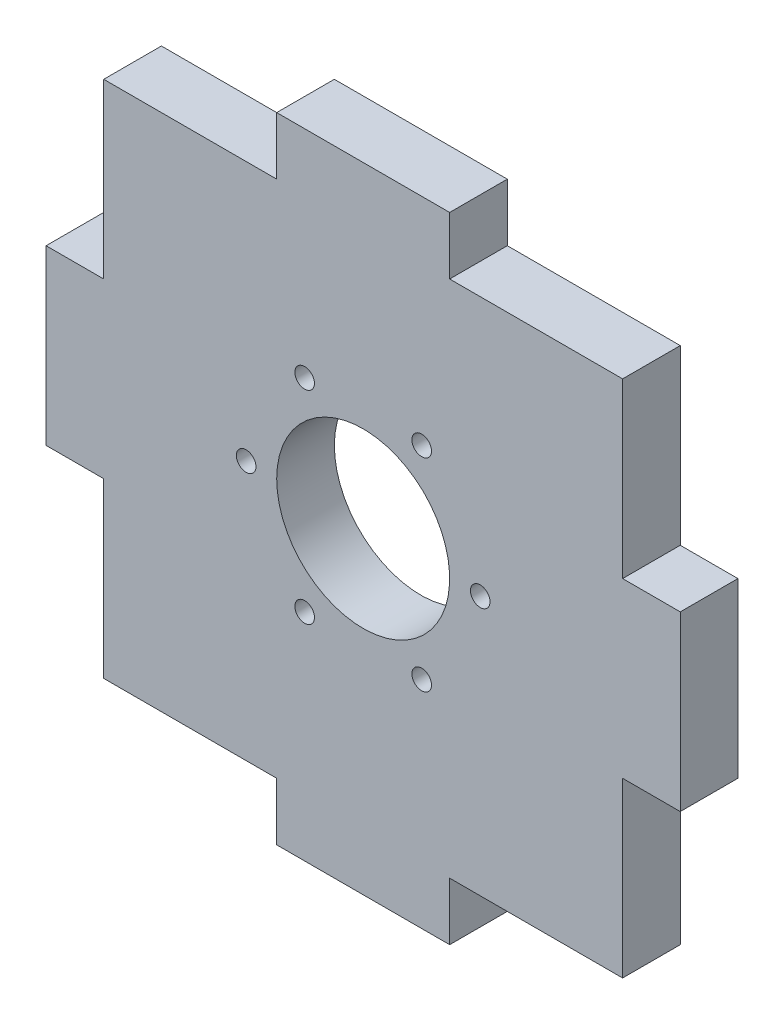
ISO-10303-21;
HEADER;
FILE_DESCRIPTION(('STEP AP214'),'2;1');
FILE_NAME('part.step','',(''),(''),'','','');
FILE_SCHEMA(('AUTOMOTIVE_DESIGN { 1 0 10303 214 1 1 1 1 }'));
ENDSEC;
DATA;
#1=APPLICATION_CONTEXT('core data for automotive mechanical design processes');
#2=APPLICATION_PROTOCOL_DEFINITION('international standard','automotive_design',2000,#1);
#3=PRODUCT_CONTEXT('',#1,'mechanical');
#4=PRODUCT('Part','Part','',(#3));
#5=PRODUCT_RELATED_PRODUCT_CATEGORY('part','',(#4));
#6=PRODUCT_DEFINITION_FORMATION('','',#4);
#7=PRODUCT_DEFINITION_CONTEXT('part definition',#1,'design');
#8=PRODUCT_DEFINITION('design','',#6,#7);
#9=PRODUCT_DEFINITION_SHAPE('','',#8);
#10=(LENGTH_UNIT() NAMED_UNIT(*) SI_UNIT(.MILLI.,.METRE.));
#11=(NAMED_UNIT(*) PLANE_ANGLE_UNIT() SI_UNIT($,.RADIAN.));
#12=(NAMED_UNIT(*) SI_UNIT($,.STERADIAN.) SOLID_ANGLE_UNIT());
#13=UNCERTAINTY_MEASURE_WITH_UNIT(LENGTH_MEASURE(1.E-05),#10,'distance_accuracy_value','');
#14=(GEOMETRIC_REPRESENTATION_CONTEXT(3) GLOBAL_UNCERTAINTY_ASSIGNED_CONTEXT((#13)) GLOBAL_UNIT_ASSIGNED_CONTEXT((#10,
#11,#12)) REPRESENTATION_CONTEXT('',''));
#15=CARTESIAN_POINT('',(0.,0.,0.));
#16=DIRECTION('',(0.,0.,1.));
#17=DIRECTION('',(1.,0.,0.));
#18=AXIS2_PLACEMENT_3D('',#15,#16,#17);
#19=CARTESIAN_POINT('',(19.75,22.5,5.));
#20=DIRECTION('',(0.,0.,-1.));
#21=DIRECTION('',(-1.,0.,0.));
#22=AXIS2_PLACEMENT_3D('',#19,#20,#21);
#23=PLANE('',#22);
#24=CARTESIAN_POINT('',(7.40000000000003,0.,5.));
#25=DIRECTION('',(0.,0.,-1.));
#26=DIRECTION('',(-1.,0.,0.));
#27=AXIS2_PLACEMENT_3D('',#24,#25,#26);
#28=CIRCLE('',#27,0.85);
#29=CARTESIAN_POINT('',(6.55000000000003,0.,5.));
#30=VERTEX_POINT('',#29);
#31=EDGE_CURVE('E309',#30,#30,#28,.F.);
#32=ORIENTED_EDGE('',*,*,#31,.F.);
#33=EDGE_LOOP('',(#32));
#34=FACE_BOUND('',#33,.T.);
#35=CARTESIAN_POINT('',(-7.82500000000002,-8.79015784841204,5.));
#36=DIRECTION('',(0.,0.,-1.));
#37=DIRECTION('',(-1.,0.,0.));
#38=AXIS2_PLACEMENT_3D('',#35,#36,#37);
#39=CIRCLE('',#38,0.85);
#40=CARTESIAN_POINT('',(-8.67500000000002,-8.79015784841204,5.));
#41=VERTEX_POINT('',#40);
#42=EDGE_CURVE('E303',#41,#41,#39,.F.);
#43=ORIENTED_EDGE('',*,*,#42,.F.);
#44=EDGE_LOOP('',(#43));
#45=FACE_BOUND('',#44,.T.);
#46=CARTESIAN_POINT('',(-7.82499999999989,8.7901578484121,5.));
#47=DIRECTION('',(0.,0.,-1.));
#48=DIRECTION('',(-1.,0.,0.));
#49=AXIS2_PLACEMENT_3D('',#46,#47,#48);
#50=CIRCLE('',#49,0.85);
#51=CARTESIAN_POINT('',(-8.67499999999989,8.7901578484121,5.));
#52=VERTEX_POINT('',#51);
#53=EDGE_CURVE('E295',#52,#52,#50,.F.);
#54=ORIENTED_EDGE('',*,*,#53,.F.);
#55=EDGE_LOOP('',(#54));
#56=FACE_BOUND('',#55,.T.);
#57=DIRECTION('',(0.,1.,0.));
#58=VECTOR('',#57,1.);
#59=CARTESIAN_POINT('',(19.75,7.5,5.));
#60=LINE('',#59,#58);
#61=CARTESIAN_POINT('',(19.75,7.5,5.));
#62=VERTEX_POINT('',#61);
#63=CARTESIAN_POINT('',(19.75,22.5,5.));
#64=VERTEX_POINT('',#63);
#65=EDGE_CURVE('E240',#62,#64,#60,.T.);
#66=ORIENTED_EDGE('',*,*,#65,.T.);
#67=DIRECTION('',(-1.,0.,0.));
#68=VECTOR('',#67,1.);
#69=CARTESIAN_POINT('',(4.74999999999998,22.5,5.));
#70=LINE('',#69,#68);
#71=CARTESIAN_POINT('',(4.74999999999998,22.5,5.));
#72=VERTEX_POINT('',#71);
#73=EDGE_CURVE('E128',#64,#72,#70,.T.);
#74=ORIENTED_EDGE('',*,*,#73,.T.);
#75=DIRECTION('',(0.,1.,0.));
#76=VECTOR('',#75,1.);
#77=CARTESIAN_POINT('',(4.74999999999998,22.5,5.));
#78=LINE('',#77,#76);
#79=CARTESIAN_POINT('',(4.74999999999998,27.5,5.));
#80=VERTEX_POINT('',#79);
#81=EDGE_CURVE('E325',#72,#80,#78,.T.);
#82=ORIENTED_EDGE('',*,*,#81,.T.);
#83=DIRECTION('',(-1.,0.,0.));
#84=VECTOR('',#83,1.);
#85=CARTESIAN_POINT('',(-10.25,27.5,5.));
#86=LINE('',#85,#84);
#87=CARTESIAN_POINT('',(-10.25,27.5,5.));
#88=VERTEX_POINT('',#87);
#89=EDGE_CURVE('E327',#80,#88,#86,.T.);
#90=ORIENTED_EDGE('',*,*,#89,.T.);
#91=DIRECTION('',(0.,-1.,0.));
#92=VECTOR('',#91,1.);
#93=CARTESIAN_POINT('',(-10.25,22.5,5.));
#94=LINE('',#93,#92);
#95=CARTESIAN_POINT('',(-10.25,22.5,5.));
#96=VERTEX_POINT('',#95);
#97=EDGE_CURVE('E329',#88,#96,#94,.T.);
#98=ORIENTED_EDGE('',*,*,#97,.T.);
#99=DIRECTION('',(-1.,0.,0.));
#100=VECTOR('',#99,1.);
#101=CARTESIAN_POINT('',(-25.25,22.5,5.));
#102=LINE('',#101,#100);
#103=CARTESIAN_POINT('',(-25.25,22.5,5.));
#104=VERTEX_POINT('',#103);
#105=EDGE_CURVE('E331',#96,#104,#102,.T.);
#106=ORIENTED_EDGE('',*,*,#105,.T.);
#107=DIRECTION('',(0.,-1.,0.));
#108=VECTOR('',#107,1.);
#109=CARTESIAN_POINT('',(-25.25,7.50000000000001,5.));
#110=LINE('',#109,#108);
#111=CARTESIAN_POINT('',(-25.25,7.50000000000001,5.));
#112=VERTEX_POINT('',#111);
#113=EDGE_CURVE('E333',#104,#112,#110,.T.);
#114=ORIENTED_EDGE('',*,*,#113,.T.);
#115=DIRECTION('',(-1.,0.,0.));
#116=VECTOR('',#115,1.);
#117=CARTESIAN_POINT('',(-25.25,7.50000000000001,5.));
#118=LINE('',#117,#116);
#119=CARTESIAN_POINT('',(-30.25,7.5,5.));
#120=VERTEX_POINT('',#119);
#121=EDGE_CURVE('E335',#112,#120,#118,.T.);
#122=ORIENTED_EDGE('',*,*,#121,.T.);
#123=DIRECTION('',(0.,-1.,0.));
#124=VECTOR('',#123,1.);
#125=CARTESIAN_POINT('',(-30.25,-7.5,5.));
#126=LINE('',#125,#124);
#127=CARTESIAN_POINT('',(-30.25,-7.5,5.));
#128=VERTEX_POINT('',#127);
#129=EDGE_CURVE('E337',#120,#128,#126,.T.);
#130=ORIENTED_EDGE('',*,*,#129,.T.);
#131=DIRECTION('',(1.,0.,0.));
#132=VECTOR('',#131,1.);
#133=CARTESIAN_POINT('',(-25.25,-7.5,5.));
#134=LINE('',#133,#132);
#135=CARTESIAN_POINT('',(-25.25,-7.5,5.));
#136=VERTEX_POINT('',#135);
#137=EDGE_CURVE('E339',#128,#136,#134,.T.);
#138=ORIENTED_EDGE('',*,*,#137,.T.);
#139=DIRECTION('',(0.,-1.,0.));
#140=VECTOR('',#139,1.);
#141=CARTESIAN_POINT('',(-25.25,-22.5,5.));
#142=LINE('',#141,#140);
#143=CARTESIAN_POINT('',(-25.25,-22.5,5.));
#144=VERTEX_POINT('',#143);
#145=EDGE_CURVE('E341',#136,#144,#142,.T.);
#146=ORIENTED_EDGE('',*,*,#145,.T.);
#147=DIRECTION('',(1.,0.,0.));
#148=VECTOR('',#147,1.);
#149=CARTESIAN_POINT('',(-25.25,-22.5,5.));
#150=LINE('',#149,#148);
#151=CARTESIAN_POINT('',(-10.25,-22.5,5.));
#152=VERTEX_POINT('',#151);
#153=EDGE_CURVE('E343',#144,#152,#150,.T.);
#154=ORIENTED_EDGE('',*,*,#153,.T.);
#155=DIRECTION('',(0.,-1.,0.));
#156=VECTOR('',#155,1.);
#157=CARTESIAN_POINT('',(-10.25,-22.5,5.));
#158=LINE('',#157,#156);
#159=CARTESIAN_POINT('',(-10.25,-27.5,5.));
#160=VERTEX_POINT('',#159);
#161=EDGE_CURVE('E345',#152,#160,#158,.T.);
#162=ORIENTED_EDGE('',*,*,#161,.T.);
#163=DIRECTION('',(1.,0.,0.));
#164=VECTOR('',#163,1.);
#165=CARTESIAN_POINT('',(4.74999999999998,-27.5,5.));
#166=LINE('',#165,#164);
#167=CARTESIAN_POINT('',(4.74999999999998,-27.5,5.));
#168=VERTEX_POINT('',#167);
#169=EDGE_CURVE('E347',#160,#168,#166,.T.);
#170=ORIENTED_EDGE('',*,*,#169,.T.);
#171=DIRECTION('',(0.,1.,0.));
#172=VECTOR('',#171,1.);
#173=CARTESIAN_POINT('',(4.74999999999998,-22.5,5.));
#174=LINE('',#173,#172);
#175=CARTESIAN_POINT('',(4.74999999999998,-22.5,5.));
#176=VERTEX_POINT('',#175);
#177=EDGE_CURVE('E349',#168,#176,#174,.T.);
#178=ORIENTED_EDGE('',*,*,#177,.T.);
#179=DIRECTION('',(1.,0.,0.));
#180=VECTOR('',#179,1.);
#181=CARTESIAN_POINT('',(4.74999999999998,-22.5,5.));
#182=LINE('',#181,#180);
#183=CARTESIAN_POINT('',(19.75,-22.5,5.));
#184=VERTEX_POINT('',#183);
#185=EDGE_CURVE('E351',#176,#184,#182,.T.);
#186=ORIENTED_EDGE('',*,*,#185,.T.);
#187=DIRECTION('',(0.,1.,0.));
#188=VECTOR('',#187,1.);
#189=CARTESIAN_POINT('',(19.75,-22.5,5.));
#190=LINE('',#189,#188);
#191=CARTESIAN_POINT('',(19.75,-7.5,5.));
#192=VERTEX_POINT('',#191);
#193=EDGE_CURVE('E183',#184,#192,#190,.T.);
#194=ORIENTED_EDGE('',*,*,#193,.T.);
#195=DIRECTION('',(1.,0.,0.));
#196=VECTOR('',#195,1.);
#197=CARTESIAN_POINT('',(19.75,-7.5,5.));
#198=LINE('',#197,#196);
#199=CARTESIAN_POINT('',(24.75,-7.5,5.));
#200=VERTEX_POINT('',#199);
#201=EDGE_CURVE('E177',#192,#200,#198,.T.);
#202=ORIENTED_EDGE('',*,*,#201,.T.);
#203=DIRECTION('',(0.,1.,0.));
#204=VECTOR('',#203,1.);
#205=CARTESIAN_POINT('',(24.75,7.5,5.));
#206=LINE('',#205,#204);
#207=CARTESIAN_POINT('',(24.75,7.5,5.));
#208=VERTEX_POINT('',#207);
#209=EDGE_CURVE('E181',#200,#208,#206,.T.);
#210=ORIENTED_EDGE('',*,*,#209,.T.);
#211=DIRECTION('',(-1.,0.,0.));
#212=VECTOR('',#211,1.);
#213=CARTESIAN_POINT('',(19.75,7.5,5.));
#214=LINE('',#213,#212);
#215=EDGE_CURVE('E49',#208,#62,#214,.T.);
#216=ORIENTED_EDGE('',*,*,#215,.T.);
#217=EDGE_LOOP('',(#66,#74,#82,#90,#98,#106,#114,#122,#130,#138,#146,#154,#162,#170,#178,#186,
#194,#202,#210,#216));
#218=FACE_BOUND('',#217,.T.);
#219=CARTESIAN_POINT('',(2.32500000000013,8.79015784841199,5.));
#220=DIRECTION('',(0.,0.,-1.));
#221=DIRECTION('',(-1.,0.,0.));
#222=AXIS2_PLACEMENT_3D('',#219,#220,#221);
#223=CIRCLE('',#222,0.849999999999998);
#224=CARTESIAN_POINT('',(1.47500000000013,8.79015784841199,5.));
#225=VERTEX_POINT('',#224);
#226=EDGE_CURVE('E291',#225,#225,#223,.F.);
#227=ORIENTED_EDGE('',*,*,#226,.F.);
#228=EDGE_LOOP('',(#227));
#229=FACE_BOUND('',#228,.T.);
#230=CARTESIAN_POINT('',(-12.9,0.,5.));
#231=DIRECTION('',(0.,0.,-1.));
#232=DIRECTION('',(-1.,0.,0.));
#233=AXIS2_PLACEMENT_3D('',#230,#231,#232);
#234=CIRCLE('',#233,0.85);
#235=CARTESIAN_POINT('',(-13.75,0.,5.));
#236=VERTEX_POINT('',#235);
#237=EDGE_CURVE('E299',#236,#236,#234,.F.);
#238=ORIENTED_EDGE('',*,*,#237,.F.);
#239=EDGE_LOOP('',(#238));
#240=FACE_BOUND('',#239,.T.);
#241=CARTESIAN_POINT('',(2.32500000000001,-8.79015784841207,5.));
#242=DIRECTION('',(0.,0.,-1.));
#243=DIRECTION('',(-1.,0.,0.));
#244=AXIS2_PLACEMENT_3D('',#241,#242,#243);
#245=CIRCLE('',#244,0.849999999999999);
#246=CARTESIAN_POINT('',(1.47500000000001,-8.79015784841207,5.));
#247=VERTEX_POINT('',#246);
#248=EDGE_CURVE('E306',#247,#247,#245,.F.);
#249=ORIENTED_EDGE('',*,*,#248,.F.);
#250=EDGE_LOOP('',(#249));
#251=FACE_BOUND('',#250,.T.);
#252=CARTESIAN_POINT('',(-2.74999999999997,0.,5.));
#253=DIRECTION('',(0.,0.,-1.));
#254=DIRECTION('',(-1.,0.,0.));
#255=AXIS2_PLACEMENT_3D('',#252,#253,#254);
#256=CIRCLE('',#255,7.5);
#257=CARTESIAN_POINT('',(-10.25,0.,5.));
#258=VERTEX_POINT('',#257);
#259=EDGE_CURVE('E205',#258,#258,#256,.F.);
#260=ORIENTED_EDGE('',*,*,#259,.F.);
#261=EDGE_LOOP('',(#260));
#262=FACE_BOUND('',#261,.T.);
#263=ADVANCED_FACE('F30',(#34,#45,#56,#218,#229,#240,#251,#262),#23,.F.);
#264=CARTESIAN_POINT('',(19.75,22.5,0.));
#265=DIRECTION('',(0.,0.,-1.));
#266=DIRECTION('',(-1.,0.,0.));
#267=AXIS2_PLACEMENT_3D('',#264,#265,#266);
#268=PLANE('',#267);
#269=CARTESIAN_POINT('',(7.40000000000003,0.,0.));
#270=DIRECTION('',(0.,0.,-1.));
#271=DIRECTION('',(-1.,0.,0.));
#272=AXIS2_PLACEMENT_3D('',#269,#270,#271);
#273=CIRCLE('',#272,0.85);
#274=CARTESIAN_POINT('',(6.55000000000003,0.,0.));
#275=VERTEX_POINT('',#274);
#276=EDGE_CURVE('E307',#275,#275,#273,.F.);
#277=ORIENTED_EDGE('',*,*,#276,.T.);
#278=EDGE_LOOP('',(#277));
#279=FACE_BOUND('',#278,.T.);
#280=CARTESIAN_POINT('',(-7.82500000000002,-8.79015784841204,0.));
#281=DIRECTION('',(0.,0.,-1.));
#282=DIRECTION('',(-1.,0.,0.));
#283=AXIS2_PLACEMENT_3D('',#280,#281,#282);
#284=CIRCLE('',#283,0.85);
#285=CARTESIAN_POINT('',(-8.67500000000002,-8.79015784841204,0.));
#286=VERTEX_POINT('',#285);
#287=EDGE_CURVE('E300',#286,#286,#284,.F.);
#288=ORIENTED_EDGE('',*,*,#287,.T.);
#289=EDGE_LOOP('',(#288));
#290=FACE_BOUND('',#289,.T.);
#291=CARTESIAN_POINT('',(-7.82499999999989,8.7901578484121,0.));
#292=DIRECTION('',(0.,0.,-1.));
#293=DIRECTION('',(-1.,0.,0.));
#294=AXIS2_PLACEMENT_3D('',#291,#292,#293);
#295=CIRCLE('',#294,0.85);
#296=CARTESIAN_POINT('',(-8.67499999999989,8.7901578484121,0.));
#297=VERTEX_POINT('',#296);
#298=EDGE_CURVE('E292',#297,#297,#295,.F.);
#299=ORIENTED_EDGE('',*,*,#298,.T.);
#300=EDGE_LOOP('',(#299));
#301=FACE_BOUND('',#300,.T.);
#302=DIRECTION('',(0.,1.,0.));
#303=VECTOR('',#302,1.);
#304=CARTESIAN_POINT('',(19.75,7.5,0.));
#305=LINE('',#304,#303);
#306=CARTESIAN_POINT('',(19.75,7.5,0.));
#307=VERTEX_POINT('',#306);
#308=CARTESIAN_POINT('',(19.75,22.5,0.));
#309=VERTEX_POINT('',#308);
#310=EDGE_CURVE('E201',#307,#309,#305,.T.);
#311=ORIENTED_EDGE('',*,*,#310,.F.);
#312=DIRECTION('',(-1.,0.,0.));
#313=VECTOR('',#312,1.);
#314=CARTESIAN_POINT('',(19.75,7.5,0.));
#315=LINE('',#314,#313);
#316=CARTESIAN_POINT('',(24.75,7.5,0.));
#317=VERTEX_POINT('',#316);
#318=EDGE_CURVE('E120',#317,#307,#315,.T.);
#319=ORIENTED_EDGE('',*,*,#318,.F.);
#320=DIRECTION('',(0.,1.,0.));
#321=VECTOR('',#320,1.);
#322=CARTESIAN_POINT('',(24.75,7.5,0.));
#323=LINE('',#322,#321);
#324=CARTESIAN_POINT('',(24.75,-7.5,0.));
#325=VERTEX_POINT('',#324);
#326=EDGE_CURVE('E114',#325,#317,#323,.T.);
#327=ORIENTED_EDGE('',*,*,#326,.F.);
#328=DIRECTION('',(1.,0.,0.));
#329=VECTOR('',#328,1.);
#330=CARTESIAN_POINT('',(19.75,-7.5,0.));
#331=LINE('',#330,#329);
#332=CARTESIAN_POINT('',(19.75,-7.5,0.));
#333=VERTEX_POINT('',#332);
#334=EDGE_CURVE('E191',#333,#325,#331,.T.);
#335=ORIENTED_EDGE('',*,*,#334,.F.);
#336=DIRECTION('',(0.,1.,0.));
#337=VECTOR('',#336,1.);
#338=CARTESIAN_POINT('',(19.75,-22.5,0.));
#339=LINE('',#338,#337);
#340=CARTESIAN_POINT('',(19.75,-22.5,0.));
#341=VERTEX_POINT('',#340);
#342=EDGE_CURVE('E235',#341,#333,#339,.T.);
#343=ORIENTED_EDGE('',*,*,#342,.F.);
#344=DIRECTION('',(1.,0.,0.));
#345=VECTOR('',#344,1.);
#346=CARTESIAN_POINT('',(4.74999999999998,-22.5,0.));
#347=LINE('',#346,#345);
#348=CARTESIAN_POINT('',(4.74999999999998,-22.5,0.));
#349=VERTEX_POINT('',#348);
#350=EDGE_CURVE('E233',#349,#341,#347,.T.);
#351=ORIENTED_EDGE('',*,*,#350,.F.);
#352=DIRECTION('',(0.,1.,0.));
#353=VECTOR('',#352,1.);
#354=CARTESIAN_POINT('',(4.74999999999998,-22.5,0.));
#355=LINE('',#354,#353);
#356=CARTESIAN_POINT('',(4.74999999999998,-27.5,0.));
#357=VERTEX_POINT('',#356);
#358=EDGE_CURVE('E231',#357,#349,#355,.T.);
#359=ORIENTED_EDGE('',*,*,#358,.F.);
#360=DIRECTION('',(1.,0.,0.));
#361=VECTOR('',#360,1.);
#362=CARTESIAN_POINT('',(4.74999999999998,-27.5,0.));
#363=LINE('',#362,#361);
#364=CARTESIAN_POINT('',(-10.25,-27.5,0.));
#365=VERTEX_POINT('',#364);
#366=EDGE_CURVE('E229',#365,#357,#363,.T.);
#367=ORIENTED_EDGE('',*,*,#366,.F.);
#368=DIRECTION('',(0.,-1.,0.));
#369=VECTOR('',#368,1.);
#370=CARTESIAN_POINT('',(-10.25,-22.5,0.));
#371=LINE('',#370,#369);
#372=CARTESIAN_POINT('',(-10.25,-22.5,0.));
#373=VERTEX_POINT('',#372);
#374=EDGE_CURVE('E227',#373,#365,#371,.T.);
#375=ORIENTED_EDGE('',*,*,#374,.F.);
#376=DIRECTION('',(1.,0.,0.));
#377=VECTOR('',#376,1.);
#378=CARTESIAN_POINT('',(-25.25,-22.5,0.));
#379=LINE('',#378,#377);
#380=CARTESIAN_POINT('',(-25.25,-22.5,0.));
#381=VERTEX_POINT('',#380);
#382=EDGE_CURVE('E225',#381,#373,#379,.T.);
#383=ORIENTED_EDGE('',*,*,#382,.F.);
#384=DIRECTION('',(0.,-1.,0.));
#385=VECTOR('',#384,1.);
#386=CARTESIAN_POINT('',(-25.25,-22.5,0.));
#387=LINE('',#386,#385);
#388=CARTESIAN_POINT('',(-25.25,-7.5,0.));
#389=VERTEX_POINT('',#388);
#390=EDGE_CURVE('E223',#389,#381,#387,.T.);
#391=ORIENTED_EDGE('',*,*,#390,.F.);
#392=DIRECTION('',(1.,0.,0.));
#393=VECTOR('',#392,1.);
#394=CARTESIAN_POINT('',(-25.25,-7.5,0.));
#395=LINE('',#394,#393);
#396=CARTESIAN_POINT('',(-30.25,-7.5,0.));
#397=VERTEX_POINT('',#396);
#398=EDGE_CURVE('E221',#397,#389,#395,.T.);
#399=ORIENTED_EDGE('',*,*,#398,.F.);
#400=DIRECTION('',(0.,-1.,0.));
#401=VECTOR('',#400,1.);
#402=CARTESIAN_POINT('',(-30.25,-7.5,0.));
#403=LINE('',#402,#401);
#404=CARTESIAN_POINT('',(-30.25,7.5,0.));
#405=VERTEX_POINT('',#404);
#406=EDGE_CURVE('E219',#405,#397,#403,.T.);
#407=ORIENTED_EDGE('',*,*,#406,.F.);
#408=DIRECTION('',(-1.,0.,0.));
#409=VECTOR('',#408,1.);
#410=CARTESIAN_POINT('',(-25.25,7.50000000000001,0.));
#411=LINE('',#410,#409);
#412=CARTESIAN_POINT('',(-25.25,7.50000000000001,0.));
#413=VERTEX_POINT('',#412);
#414=EDGE_CURVE('E217',#413,#405,#411,.T.);
#415=ORIENTED_EDGE('',*,*,#414,.F.);
#416=DIRECTION('',(0.,-1.,0.));
#417=VECTOR('',#416,1.);
#418=CARTESIAN_POINT('',(-25.25,7.50000000000001,0.));
#419=LINE('',#418,#417);
#420=CARTESIAN_POINT('',(-25.25,22.5,0.));
#421=VERTEX_POINT('',#420);
#422=EDGE_CURVE('E215',#421,#413,#419,.T.);
#423=ORIENTED_EDGE('',*,*,#422,.F.);
#424=DIRECTION('',(-1.,0.,0.));
#425=VECTOR('',#424,1.);
#426=CARTESIAN_POINT('',(-25.25,22.5,0.));
#427=LINE('',#426,#425);
#428=CARTESIAN_POINT('',(-10.25,22.5,0.));
#429=VERTEX_POINT('',#428);
#430=EDGE_CURVE('E213',#429,#421,#427,.T.);
#431=ORIENTED_EDGE('',*,*,#430,.F.);
#432=DIRECTION('',(0.,-1.,0.));
#433=VECTOR('',#432,1.);
#434=CARTESIAN_POINT('',(-10.25,22.5,0.));
#435=LINE('',#434,#433);
#436=CARTESIAN_POINT('',(-10.25,27.5,0.));
#437=VERTEX_POINT('',#436);
#438=EDGE_CURVE('E211',#437,#429,#435,.T.);
#439=ORIENTED_EDGE('',*,*,#438,.F.);
#440=DIRECTION('',(-1.,0.,0.));
#441=VECTOR('',#440,1.);
#442=CARTESIAN_POINT('',(-10.25,27.5,0.));
#443=LINE('',#442,#441);
#444=CARTESIAN_POINT('',(4.74999999999998,27.5,0.));
#445=VERTEX_POINT('',#444);
#446=EDGE_CURVE('E209',#445,#437,#443,.T.);
#447=ORIENTED_EDGE('',*,*,#446,.F.);
#448=DIRECTION('',(0.,1.,0.));
#449=VECTOR('',#448,1.);
#450=CARTESIAN_POINT('',(4.74999999999998,22.5,0.));
#451=LINE('',#450,#449);
#452=CARTESIAN_POINT('',(4.74999999999998,22.5,0.));
#453=VERTEX_POINT('',#452);
#454=EDGE_CURVE('E207',#453,#445,#451,.T.);
#455=ORIENTED_EDGE('',*,*,#454,.F.);
#456=DIRECTION('',(-1.,0.,0.));
#457=VECTOR('',#456,1.);
#458=CARTESIAN_POINT('',(4.74999999999998,22.5,0.));
#459=LINE('',#458,#457);
#460=EDGE_CURVE('E204',#309,#453,#459,.T.);
#461=ORIENTED_EDGE('',*,*,#460,.F.);
#462=EDGE_LOOP('',(#311,#319,#327,#335,#343,#351,#359,#367,#375,#383,#391,#399,#407,#415,#423,
#431,#439,#447,#455,#461));
#463=FACE_BOUND('',#462,.T.);
#464=CARTESIAN_POINT('',(2.32500000000013,8.79015784841199,0.));
#465=DIRECTION('',(0.,0.,-1.));
#466=DIRECTION('',(-1.,0.,0.));
#467=AXIS2_PLACEMENT_3D('',#464,#465,#466);
#468=CIRCLE('',#467,0.849999999999998);
#469=CARTESIAN_POINT('',(1.47500000000013,8.79015784841199,0.));
#470=VERTEX_POINT('',#469);
#471=EDGE_CURVE('E288',#470,#470,#468,.F.);
#472=ORIENTED_EDGE('',*,*,#471,.T.);
#473=EDGE_LOOP('',(#472));
#474=FACE_BOUND('',#473,.T.);
#475=CARTESIAN_POINT('',(-12.9,0.,0.));
#476=DIRECTION('',(0.,0.,-1.));
#477=DIRECTION('',(-1.,0.,0.));
#478=AXIS2_PLACEMENT_3D('',#475,#476,#477);
#479=CIRCLE('',#478,0.85);
#480=CARTESIAN_POINT('',(-13.75,0.,0.));
#481=VERTEX_POINT('',#480);
#482=EDGE_CURVE('E296',#481,#481,#479,.F.);
#483=ORIENTED_EDGE('',*,*,#482,.T.);
#484=EDGE_LOOP('',(#483));
#485=FACE_BOUND('',#484,.T.);
#486=CARTESIAN_POINT('',(2.32500000000001,-8.79015784841207,0.));
#487=DIRECTION('',(0.,0.,-1.));
#488=DIRECTION('',(-1.,0.,0.));
#489=AXIS2_PLACEMENT_3D('',#486,#487,#488);
#490=CIRCLE('',#489,0.849999999999999);
#491=CARTESIAN_POINT('',(1.47500000000001,-8.79015784841207,0.));
#492=VERTEX_POINT('',#491);
#493=EDGE_CURVE('E304',#492,#492,#490,.F.);
#494=ORIENTED_EDGE('',*,*,#493,.T.);
#495=EDGE_LOOP('',(#494));
#496=FACE_BOUND('',#495,.T.);
#497=CARTESIAN_POINT('',(-2.74999999999997,0.,0.));
#498=DIRECTION('',(0.,0.,-1.));
#499=DIRECTION('',(-1.,0.,0.));
#500=AXIS2_PLACEMENT_3D('',#497,#498,#499);
#501=CIRCLE('',#500,7.5);
#502=CARTESIAN_POINT('',(-10.25,0.,0.));
#503=VERTEX_POINT('',#502);
#504=EDGE_CURVE('E34',#503,#503,#501,.F.);
#505=ORIENTED_EDGE('',*,*,#504,.T.);
#506=EDGE_LOOP('',(#505));
#507=FACE_BOUND('',#506,.T.);
#508=ADVANCED_FACE('F364',(#279,#290,#301,#463,#474,#485,#496,#507),#268,.T.);
#509=CARTESIAN_POINT('',(19.75,7.5,5.));
#510=DIRECTION('',(-1.,0.,0.));
#511=DIRECTION('',(0.,0.,1.));
#512=AXIS2_PLACEMENT_3D('',#509,#510,#511);
#513=PLANE('',#512);
#514=ORIENTED_EDGE('',*,*,#310,.T.);
#515=DIRECTION('',(0.,0.,-1.));
#516=VECTOR('',#515,1.);
#517=CARTESIAN_POINT('',(19.75,22.5,5.));
#518=LINE('',#517,#516);
#519=EDGE_CURVE('E11',#64,#309,#518,.T.);
#520=ORIENTED_EDGE('',*,*,#519,.F.);
#521=ORIENTED_EDGE('',*,*,#65,.F.);
#522=DIRECTION('',(0.,0.,-1.));
#523=VECTOR('',#522,1.);
#524=CARTESIAN_POINT('',(19.75,7.5,5.));
#525=LINE('',#524,#523);
#526=EDGE_CURVE('E197',#62,#307,#525,.T.);
#527=ORIENTED_EDGE('',*,*,#526,.T.);
#528=EDGE_LOOP('',(#514,#520,#521,#527));
#529=FACE_BOUND('',#528,.T.);
#530=ADVANCED_FACE('F32',(#529),#513,.F.);
#531=CARTESIAN_POINT('',(4.74999999999998,22.5,5.));
#532=DIRECTION('',(0.,-1.,0.));
#533=DIRECTION('',(1.,0.,0.));
#534=AXIS2_PLACEMENT_3D('',#531,#532,#533);
#535=PLANE('',#534);
#536=ORIENTED_EDGE('',*,*,#460,.T.);
#537=DIRECTION('',(0.,0.,-1.));
#538=VECTOR('',#537,1.);
#539=CARTESIAN_POINT('',(4.74999999999998,22.5,5.));
#540=LINE('',#539,#538);
#541=EDGE_CURVE('E40',#72,#453,#540,.T.);
#542=ORIENTED_EDGE('',*,*,#541,.F.);
#543=ORIENTED_EDGE('',*,*,#73,.F.);
#544=ORIENTED_EDGE('',*,*,#519,.T.);
#545=EDGE_LOOP('',(#536,#542,#543,#544));
#546=FACE_BOUND('',#545,.T.);
#547=ADVANCED_FACE('F629',(#546),#535,.F.);
#548=CARTESIAN_POINT('',(4.74999999999998,22.5,5.));
#549=DIRECTION('',(-1.,0.,0.));
#550=DIRECTION('',(0.,-1.,0.));
#551=AXIS2_PLACEMENT_3D('',#548,#549,#550);
#552=PLANE('',#551);
#553=ORIENTED_EDGE('',*,*,#454,.T.);
#554=DIRECTION('',(0.,0.,-1.));
#555=VECTOR('',#554,1.);
#556=CARTESIAN_POINT('',(4.74999999999998,27.5,5.));
#557=LINE('',#556,#555);
#558=EDGE_CURVE('E283',#80,#445,#557,.T.);
#559=ORIENTED_EDGE('',*,*,#558,.F.);
#560=ORIENTED_EDGE('',*,*,#81,.F.);
#561=ORIENTED_EDGE('',*,*,#541,.T.);
#562=EDGE_LOOP('',(#553,#559,#560,#561));
#563=FACE_BOUND('',#562,.T.);
#564=ADVANCED_FACE('F620',(#563),#552,.F.);
#565=CARTESIAN_POINT('',(-10.25,27.5,5.));
#566=DIRECTION('',(0.,-1.,0.));
#567=DIRECTION('',(1.,0.,0.));
#568=AXIS2_PLACEMENT_3D('',#565,#566,#567);
#569=PLANE('',#568);
#570=ORIENTED_EDGE('',*,*,#446,.T.);
#571=DIRECTION('',(0.,0.,-1.));
#572=VECTOR('',#571,1.);
#573=CARTESIAN_POINT('',(-10.25,27.5,5.));
#574=LINE('',#573,#572);
#575=EDGE_CURVE('E280',#88,#437,#574,.T.);
#576=ORIENTED_EDGE('',*,*,#575,.F.);
#577=ORIENTED_EDGE('',*,*,#89,.F.);
#578=ORIENTED_EDGE('',*,*,#558,.T.);
#579=EDGE_LOOP('',(#570,#576,#577,#578));
#580=FACE_BOUND('',#579,.T.);
#581=ADVANCED_FACE('F611',(#580),#569,.F.);
#582=CARTESIAN_POINT('',(-10.25,22.5,5.));
#583=DIRECTION('',(1.,0.,0.));
#584=DIRECTION('',(0.,0.,-1.));
#585=AXIS2_PLACEMENT_3D('',#582,#583,#584);
#586=PLANE('',#585);
#587=ORIENTED_EDGE('',*,*,#438,.T.);
#588=DIRECTION('',(0.,0.,-1.));
#589=VECTOR('',#588,1.);
#590=CARTESIAN_POINT('',(-10.25,22.5,5.));
#591=LINE('',#590,#589);
#592=EDGE_CURVE('E277',#96,#429,#591,.T.);
#593=ORIENTED_EDGE('',*,*,#592,.F.);
#594=ORIENTED_EDGE('',*,*,#97,.F.);
#595=ORIENTED_EDGE('',*,*,#575,.T.);
#596=EDGE_LOOP('',(#587,#593,#594,#595));
#597=FACE_BOUND('',#596,.T.);
#598=ADVANCED_FACE('F602',(#597),#586,.F.);
#599=CARTESIAN_POINT('',(-25.25,22.5,5.));
#600=DIRECTION('',(0.,-1.,0.));
#601=DIRECTION('',(0.,0.,-1.));
#602=AXIS2_PLACEMENT_3D('',#599,#600,#601);
#603=PLANE('',#602);
#604=ORIENTED_EDGE('',*,*,#430,.T.);
#605=DIRECTION('',(0.,0.,-1.));
#606=VECTOR('',#605,1.);
#607=CARTESIAN_POINT('',(-25.25,22.5,5.));
#608=LINE('',#607,#606);
#609=EDGE_CURVE('E274',#104,#421,#608,.T.);
#610=ORIENTED_EDGE('',*,*,#609,.F.);
#611=ORIENTED_EDGE('',*,*,#105,.F.);
#612=ORIENTED_EDGE('',*,*,#592,.T.);
#613=EDGE_LOOP('',(#604,#610,#611,#612));
#614=FACE_BOUND('',#613,.T.);
#615=ADVANCED_FACE('F593',(#614),#603,.F.);
#616=CARTESIAN_POINT('',(-25.25,7.50000000000001,5.));
#617=DIRECTION('',(1.,0.,0.));
#618=DIRECTION('',(0.,0.,-1.));
#619=AXIS2_PLACEMENT_3D('',#616,#617,#618);
#620=PLANE('',#619);
#621=ORIENTED_EDGE('',*,*,#422,.T.);
#622=DIRECTION('',(0.,0.,-1.));
#623=VECTOR('',#622,1.);
#624=CARTESIAN_POINT('',(-25.25,7.50000000000001,5.));
#625=LINE('',#624,#623);
#626=EDGE_CURVE('E271',#112,#413,#625,.T.);
#627=ORIENTED_EDGE('',*,*,#626,.F.);
#628=ORIENTED_EDGE('',*,*,#113,.F.);
#629=ORIENTED_EDGE('',*,*,#609,.T.);
#630=EDGE_LOOP('',(#621,#627,#628,#629));
#631=FACE_BOUND('',#630,.T.);
#632=ADVANCED_FACE('F584',(#631),#620,.F.);
#633=CARTESIAN_POINT('',(-25.25,7.50000000000001,5.));
#634=DIRECTION('',(0.,-1.,0.));
#635=DIRECTION('',(1.,0.,0.));
#636=AXIS2_PLACEMENT_3D('',#633,#634,#635);
#637=PLANE('',#636);
#638=ORIENTED_EDGE('',*,*,#414,.T.);
#639=DIRECTION('',(0.,0.,-1.));
#640=VECTOR('',#639,1.);
#641=CARTESIAN_POINT('',(-30.25,7.5,5.));
#642=LINE('',#641,#640);
#643=EDGE_CURVE('E268',#120,#405,#642,.T.);
#644=ORIENTED_EDGE('',*,*,#643,.F.);
#645=ORIENTED_EDGE('',*,*,#121,.F.);
#646=ORIENTED_EDGE('',*,*,#626,.T.);
#647=EDGE_LOOP('',(#638,#644,#645,#646));
#648=FACE_BOUND('',#647,.T.);
#649=ADVANCED_FACE('F575',(#648),#637,.F.);
#650=CARTESIAN_POINT('',(-30.25,-7.5,5.));
#651=DIRECTION('',(1.,0.,0.));
#652=DIRECTION('',(0.,1.,0.));
#653=AXIS2_PLACEMENT_3D('',#650,#651,#652);
#654=PLANE('',#653);
#655=ORIENTED_EDGE('',*,*,#406,.T.);
#656=DIRECTION('',(0.,0.,-1.));
#657=VECTOR('',#656,1.);
#658=CARTESIAN_POINT('',(-30.25,-7.5,5.));
#659=LINE('',#658,#657);
#660=EDGE_CURVE('E265',#128,#397,#659,.T.);
#661=ORIENTED_EDGE('',*,*,#660,.F.);
#662=ORIENTED_EDGE('',*,*,#129,.F.);
#663=ORIENTED_EDGE('',*,*,#643,.T.);
#664=EDGE_LOOP('',(#655,#661,#662,#663));
#665=FACE_BOUND('',#664,.T.);
#666=ADVANCED_FACE('F566',(#665),#654,.F.);
#667=CARTESIAN_POINT('',(-25.25,-7.5,5.));
#668=DIRECTION('',(0.,1.,0.));
#669=DIRECTION('',(0.,0.,1.));
#670=AXIS2_PLACEMENT_3D('',#667,#668,#669);
#671=PLANE('',#670);
#672=ORIENTED_EDGE('',*,*,#398,.T.);
#673=DIRECTION('',(0.,0.,-1.));
#674=VECTOR('',#673,1.);
#675=CARTESIAN_POINT('',(-25.25,-7.5,5.));
#676=LINE('',#675,#674);
#677=EDGE_CURVE('E262',#136,#389,#676,.T.);
#678=ORIENTED_EDGE('',*,*,#677,.F.);
#679=ORIENTED_EDGE('',*,*,#137,.F.);
#680=ORIENTED_EDGE('',*,*,#660,.T.);
#681=EDGE_LOOP('',(#672,#678,#679,#680));
#682=FACE_BOUND('',#681,.T.);
#683=ADVANCED_FACE('F557',(#682),#671,.F.);
#684=CARTESIAN_POINT('',(-25.25,-22.5,5.));
#685=DIRECTION('',(1.,0.,0.));
#686=DIRECTION('',(0.,0.,-1.));
#687=AXIS2_PLACEMENT_3D('',#684,#685,#686);
#688=PLANE('',#687);
#689=ORIENTED_EDGE('',*,*,#390,.T.);
#690=DIRECTION('',(0.,0.,-1.));
#691=VECTOR('',#690,1.);
#692=CARTESIAN_POINT('',(-25.25,-22.5,5.));
#693=LINE('',#692,#691);
#694=EDGE_CURVE('E259',#144,#381,#693,.T.);
#695=ORIENTED_EDGE('',*,*,#694,.F.);
#696=ORIENTED_EDGE('',*,*,#145,.F.);
#697=ORIENTED_EDGE('',*,*,#677,.T.);
#698=EDGE_LOOP('',(#689,#695,#696,#697));
#699=FACE_BOUND('',#698,.T.);
#700=ADVANCED_FACE('F548',(#699),#688,.F.);
#701=CARTESIAN_POINT('',(-25.25,-22.5,5.));
#702=DIRECTION('',(0.,1.,0.));
#703=DIRECTION('',(0.,0.,1.));
#704=AXIS2_PLACEMENT_3D('',#701,#702,#703);
#705=PLANE('',#704);
#706=ORIENTED_EDGE('',*,*,#382,.T.);
#707=DIRECTION('',(0.,0.,-1.));
#708=VECTOR('',#707,1.);
#709=CARTESIAN_POINT('',(-10.25,-22.5,5.));
#710=LINE('',#709,#708);
#711=EDGE_CURVE('E256',#152,#373,#710,.T.);
#712=ORIENTED_EDGE('',*,*,#711,.F.);
#713=ORIENTED_EDGE('',*,*,#153,.F.);
#714=ORIENTED_EDGE('',*,*,#694,.T.);
#715=EDGE_LOOP('',(#706,#712,#713,#714));
#716=FACE_BOUND('',#715,.T.);
#717=ADVANCED_FACE('F539',(#716),#705,.F.);
#718=CARTESIAN_POINT('',(-10.25,-22.5,5.));
#719=DIRECTION('',(1.,0.,0.));
#720=DIRECTION('',(0.,1.,0.));
#721=AXIS2_PLACEMENT_3D('',#718,#719,#720);
#722=PLANE('',#721);
#723=ORIENTED_EDGE('',*,*,#374,.T.);
#724=DIRECTION('',(0.,0.,-1.));
#725=VECTOR('',#724,1.);
#726=CARTESIAN_POINT('',(-10.25,-27.5,5.));
#727=LINE('',#726,#725);
#728=EDGE_CURVE('E253',#160,#365,#727,.T.);
#729=ORIENTED_EDGE('',*,*,#728,.F.);
#730=ORIENTED_EDGE('',*,*,#161,.F.);
#731=ORIENTED_EDGE('',*,*,#711,.T.);
#732=EDGE_LOOP('',(#723,#729,#730,#731));
#733=FACE_BOUND('',#732,.T.);
#734=ADVANCED_FACE('F530',(#733),#722,.F.);
#735=CARTESIAN_POINT('',(4.74999999999998,-27.5,5.));
#736=DIRECTION('',(0.,1.,0.));
#737=DIRECTION('',(-1.,0.,0.));
#738=AXIS2_PLACEMENT_3D('',#735,#736,#737);
#739=PLANE('',#738);
#740=ORIENTED_EDGE('',*,*,#366,.T.);
#741=DIRECTION('',(0.,0.,-1.));
#742=VECTOR('',#741,1.);
#743=CARTESIAN_POINT('',(4.74999999999998,-27.5,5.));
#744=LINE('',#743,#742);
#745=EDGE_CURVE('E250',#168,#357,#744,.T.);
#746=ORIENTED_EDGE('',*,*,#745,.F.);
#747=ORIENTED_EDGE('',*,*,#169,.F.);
#748=ORIENTED_EDGE('',*,*,#728,.T.);
#749=EDGE_LOOP('',(#740,#746,#747,#748));
#750=FACE_BOUND('',#749,.T.);
#751=ADVANCED_FACE('F521',(#750),#739,.F.);
#752=CARTESIAN_POINT('',(4.74999999999998,-22.5,5.));
#753=DIRECTION('',(-1.,0.,0.));
#754=DIRECTION('',(0.,-1.,0.));
#755=AXIS2_PLACEMENT_3D('',#752,#753,#754);
#756=PLANE('',#755);
#757=ORIENTED_EDGE('',*,*,#358,.T.);
#758=DIRECTION('',(0.,0.,-1.));
#759=VECTOR('',#758,1.);
#760=CARTESIAN_POINT('',(4.74999999999998,-22.5,5.));
#761=LINE('',#760,#759);
#762=EDGE_CURVE('E247',#176,#349,#761,.T.);
#763=ORIENTED_EDGE('',*,*,#762,.F.);
#764=ORIENTED_EDGE('',*,*,#177,.F.);
#765=ORIENTED_EDGE('',*,*,#745,.T.);
#766=EDGE_LOOP('',(#757,#763,#764,#765));
#767=FACE_BOUND('',#766,.T.);
#768=ADVANCED_FACE('F513',(#767),#756,.F.);
#769=CARTESIAN_POINT('',(4.74999999999998,-22.5,5.));
#770=DIRECTION('',(0.,1.,0.));
#771=DIRECTION('',(0.,0.,1.));
#772=AXIS2_PLACEMENT_3D('',#769,#770,#771);
#773=PLANE('',#772);
#774=ORIENTED_EDGE('',*,*,#350,.T.);
#775=DIRECTION('',(0.,0.,-1.));
#776=VECTOR('',#775,1.);
#777=CARTESIAN_POINT('',(19.75,-22.5,5.));
#778=LINE('',#777,#776);
#779=EDGE_CURVE('E244',#184,#341,#778,.T.);
#780=ORIENTED_EDGE('',*,*,#779,.F.);
#781=ORIENTED_EDGE('',*,*,#185,.F.);
#782=ORIENTED_EDGE('',*,*,#762,.T.);
#783=EDGE_LOOP('',(#774,#780,#781,#782));
#784=FACE_BOUND('',#783,.T.);
#785=ADVANCED_FACE('F357',(#784),#773,.F.);
#786=CARTESIAN_POINT('',(19.75,-22.5,5.));
#787=DIRECTION('',(-1.,0.,0.));
#788=DIRECTION('',(0.,-1.,0.));
#789=AXIS2_PLACEMENT_3D('',#786,#787,#788);
#790=PLANE('',#789);
#791=ORIENTED_EDGE('',*,*,#342,.T.);
#792=DIRECTION('',(0.,0.,-1.));
#793=VECTOR('',#792,1.);
#794=CARTESIAN_POINT('',(19.75,-7.5,5.));
#795=LINE('',#794,#793);
#796=EDGE_CURVE('E192',#192,#333,#795,.T.);
#797=ORIENTED_EDGE('',*,*,#796,.F.);
#798=ORIENTED_EDGE('',*,*,#193,.F.);
#799=ORIENTED_EDGE('',*,*,#779,.T.);
#800=EDGE_LOOP('',(#791,#797,#798,#799));
#801=FACE_BOUND('',#800,.T.);
#802=ADVANCED_FACE('F361',(#801),#790,.F.);
#803=CARTESIAN_POINT('',(19.75,-7.5,5.));
#804=DIRECTION('',(0.,1.,0.));
#805=DIRECTION('',(-1.,0.,0.));
#806=AXIS2_PLACEMENT_3D('',#803,#804,#805);
#807=PLANE('',#806);
#808=ORIENTED_EDGE('',*,*,#334,.T.);
#809=DIRECTION('',(0.,0.,-1.));
#810=VECTOR('',#809,1.);
#811=CARTESIAN_POINT('',(24.75,-7.5,5.));
#812=LINE('',#811,#810);
#813=EDGE_CURVE('E188',#200,#325,#812,.T.);
#814=ORIENTED_EDGE('',*,*,#813,.F.);
#815=ORIENTED_EDGE('',*,*,#201,.F.);
#816=ORIENTED_EDGE('',*,*,#796,.T.);
#817=EDGE_LOOP('',(#808,#814,#815,#816));
#818=FACE_BOUND('',#817,.T.);
#819=ADVANCED_FACE('F189',(#818),#807,.F.);
#820=CARTESIAN_POINT('',(24.75,7.5,5.));
#821=DIRECTION('',(-1.,0.,0.));
#822=DIRECTION('',(0.,-1.,0.));
#823=AXIS2_PLACEMENT_3D('',#820,#821,#822);
#824=PLANE('',#823);
#825=ORIENTED_EDGE('',*,*,#326,.T.);
#826=DIRECTION('',(0.,0.,-1.));
#827=VECTOR('',#826,1.);
#828=CARTESIAN_POINT('',(24.75,7.5,5.));
#829=LINE('',#828,#827);
#830=EDGE_CURVE('E193',#208,#317,#829,.T.);
#831=ORIENTED_EDGE('',*,*,#830,.F.);
#832=ORIENTED_EDGE('',*,*,#209,.F.);
#833=ORIENTED_EDGE('',*,*,#813,.T.);
#834=EDGE_LOOP('',(#825,#831,#832,#833));
#835=FACE_BOUND('',#834,.T.);
#836=ADVANCED_FACE('F195',(#835),#824,.F.);
#837=CARTESIAN_POINT('',(19.75,7.5,5.));
#838=DIRECTION('',(0.,-1.,0.));
#839=DIRECTION('',(0.,0.,-1.));
#840=AXIS2_PLACEMENT_3D('',#837,#838,#839);
#841=PLANE('',#840);
#842=ORIENTED_EDGE('',*,*,#318,.T.);
#843=ORIENTED_EDGE('',*,*,#526,.F.);
#844=ORIENTED_EDGE('',*,*,#215,.F.);
#845=ORIENTED_EDGE('',*,*,#830,.T.);
#846=EDGE_LOOP('',(#842,#843,#844,#845));
#847=FACE_BOUND('',#846,.T.);
#848=ADVANCED_FACE('F370',(#847),#841,.F.);
#849=CARTESIAN_POINT('',(2.32500000000013,8.79015784841199,9.55000000000001));
#850=DIRECTION('',(0.,0.,-1.));
#851=DIRECTION('',(1.,0.,0.));
#852=AXIS2_PLACEMENT_3D('',#849,#850,#851);
#853=CYLINDRICAL_SURFACE('',#852,0.849999999999998);
#854=ORIENTED_EDGE('',*,*,#471,.F.);
#855=EDGE_LOOP('',(#854));
#856=FACE_BOUND('',#855,.T.);
#857=ORIENTED_EDGE('',*,*,#226,.T.);
#858=EDGE_LOOP('',(#857));
#859=FACE_BOUND('',#858,.T.);
#860=ADVANCED_FACE('F372',(#856,#859),#853,.F.);
#861=CARTESIAN_POINT('',(-7.82499999999989,8.7901578484121,9.55000000000001));
#862=DIRECTION('',(0.,0.,-1.));
#863=DIRECTION('',(1.,0.,0.));
#864=AXIS2_PLACEMENT_3D('',#861,#862,#863);
#865=CYLINDRICAL_SURFACE('',#864,0.85);
#866=ORIENTED_EDGE('',*,*,#298,.F.);
#867=EDGE_LOOP('',(#866));
#868=FACE_BOUND('',#867,.T.);
#869=ORIENTED_EDGE('',*,*,#53,.T.);
#870=EDGE_LOOP('',(#869));
#871=FACE_BOUND('',#870,.T.);
#872=ADVANCED_FACE('F378',(#868,#871),#865,.F.);
#873=CARTESIAN_POINT('',(-12.9,0.,9.55000000000001));
#874=DIRECTION('',(0.,0.,-1.));
#875=DIRECTION('',(1.,0.,0.));
#876=AXIS2_PLACEMENT_3D('',#873,#874,#875);
#877=CYLINDRICAL_SURFACE('',#876,0.85);
#878=ORIENTED_EDGE('',*,*,#482,.F.);
#879=EDGE_LOOP('',(#878));
#880=FACE_BOUND('',#879,.T.);
#881=ORIENTED_EDGE('',*,*,#237,.T.);
#882=EDGE_LOOP('',(#881));
#883=FACE_BOUND('',#882,.T.);
#884=ADVANCED_FACE('F407',(#880,#883),#877,.F.);
#885=CARTESIAN_POINT('',(-7.82500000000002,-8.79015784841204,9.55000000000001));
#886=DIRECTION('',(0.,0.,-1.));
#887=DIRECTION('',(1.,0.,0.));
#888=AXIS2_PLACEMENT_3D('',#885,#886,#887);
#889=CYLINDRICAL_SURFACE('',#888,0.85);
#890=ORIENTED_EDGE('',*,*,#287,.F.);
#891=EDGE_LOOP('',(#890));
#892=FACE_BOUND('',#891,.T.);
#893=ORIENTED_EDGE('',*,*,#42,.T.);
#894=EDGE_LOOP('',(#893));
#895=FACE_BOUND('',#894,.T.);
#896=ADVANCED_FACE('F403',(#892,#895),#889,.F.);
#897=CARTESIAN_POINT('',(2.32500000000001,-8.79015784841207,9.55000000000001));
#898=DIRECTION('',(0.,0.,-1.));
#899=DIRECTION('',(1.,0.,0.));
#900=AXIS2_PLACEMENT_3D('',#897,#898,#899);
#901=CYLINDRICAL_SURFACE('',#900,0.849999999999999);
#902=ORIENTED_EDGE('',*,*,#493,.F.);
#903=EDGE_LOOP('',(#902));
#904=FACE_BOUND('',#903,.T.);
#905=ORIENTED_EDGE('',*,*,#248,.T.);
#906=EDGE_LOOP('',(#905));
#907=FACE_BOUND('',#906,.T.);
#908=ADVANCED_FACE('F399',(#904,#907),#901,.F.);
#909=CARTESIAN_POINT('',(7.40000000000003,0.,9.55000000000001));
#910=DIRECTION('',(0.,0.,-1.));
#911=DIRECTION('',(1.,0.,0.));
#912=AXIS2_PLACEMENT_3D('',#909,#910,#911);
#913=CYLINDRICAL_SURFACE('',#912,0.85);
#914=ORIENTED_EDGE('',*,*,#276,.F.);
#915=EDGE_LOOP('',(#914));
#916=FACE_BOUND('',#915,.T.);
#917=ORIENTED_EDGE('',*,*,#31,.T.);
#918=EDGE_LOOP('',(#917));
#919=FACE_BOUND('',#918,.T.);
#920=ADVANCED_FACE('F395',(#916,#919),#913,.F.);
#921=CARTESIAN_POINT('',(-2.74999999999997,0.,9.55000000000001));
#922=DIRECTION('',(0.,0.,-1.));
#923=DIRECTION('',(1.,0.,0.));
#924=AXIS2_PLACEMENT_3D('',#921,#922,#923);
#925=CYLINDRICAL_SURFACE('',#924,7.5);
#926=ORIENTED_EDGE('',*,*,#504,.F.);
#927=EDGE_LOOP('',(#926));
#928=FACE_BOUND('',#927,.T.);
#929=ORIENTED_EDGE('',*,*,#259,.T.);
#930=EDGE_LOOP('',(#929));
#931=FACE_BOUND('',#930,.T.);
#932=ADVANCED_FACE('F392',(#928,#931),#925,.F.);
#933=CLOSED_SHELL('',(#263,#508,#530,#547,#564,#581,#598,#615,#632,#649,#666,#683,#700,#717,
#734,#751,#768,#785,#802,#819,#836,#848,#860,#872,#884,#896,#908,#920,#932));
#934=MANIFOLD_SOLID_BREP('B2',#933);
#935=ADVANCED_BREP_SHAPE_REPRESENTATION('',(#18,#934),#14);
#936=SHAPE_DEFINITION_REPRESENTATION(#9,#935);
ENDSEC;
END-ISO-10303-21;
